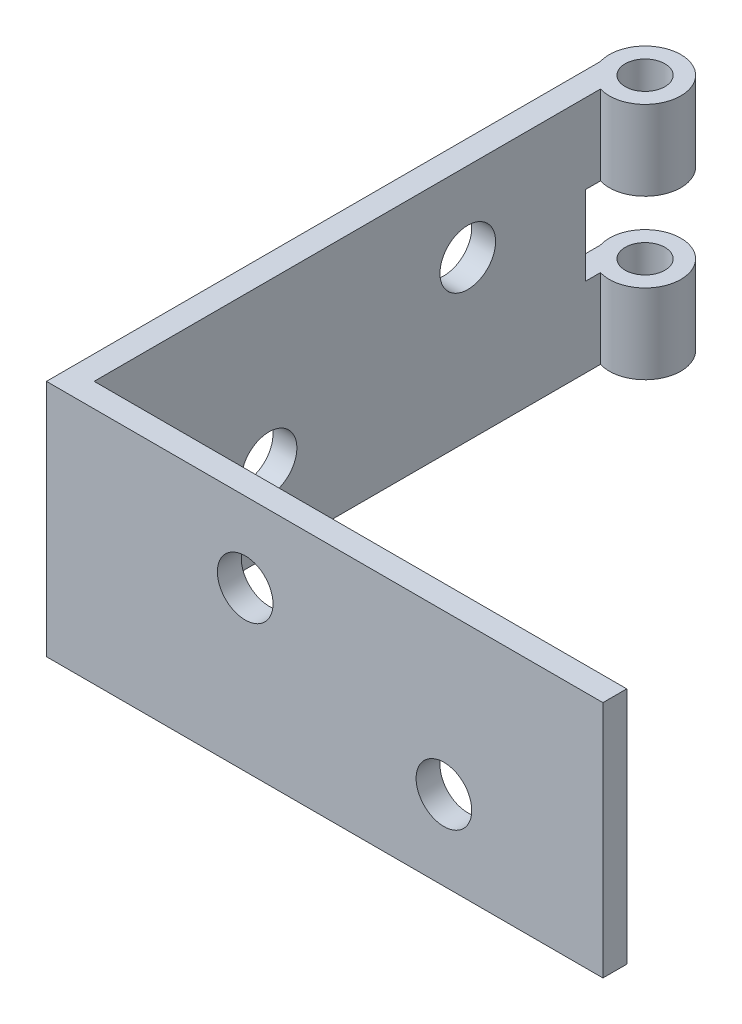
ISO-10303-21;
HEADER;
FILE_DESCRIPTION(('STEP AP214'),'2;1');
FILE_NAME('part.step','',(''),(''),'','','');
FILE_SCHEMA(('AUTOMOTIVE_DESIGN { 1 0 10303 214 1 1 1 1 }'));
ENDSEC;
DATA;
#1=APPLICATION_CONTEXT('core data for automotive mechanical design processes');
#2=APPLICATION_PROTOCOL_DEFINITION('international standard','automotive_design',2000,#1);
#3=PRODUCT_CONTEXT('',#1,'mechanical');
#4=PRODUCT('Part','Part','',(#3));
#5=PRODUCT_RELATED_PRODUCT_CATEGORY('part','',(#4));
#6=PRODUCT_DEFINITION_FORMATION('','',#4);
#7=PRODUCT_DEFINITION_CONTEXT('part definition',#1,'design');
#8=PRODUCT_DEFINITION('design','',#6,#7);
#9=PRODUCT_DEFINITION_SHAPE('','',#8);
#10=(LENGTH_UNIT() NAMED_UNIT(*) SI_UNIT(.MILLI.,.METRE.));
#11=(NAMED_UNIT(*) PLANE_ANGLE_UNIT() SI_UNIT($,.RADIAN.));
#12=(NAMED_UNIT(*) SI_UNIT($,.STERADIAN.) SOLID_ANGLE_UNIT());
#13=UNCERTAINTY_MEASURE_WITH_UNIT(LENGTH_MEASURE(1.E-05),#10,'distance_accuracy_value','');
#14=(GEOMETRIC_REPRESENTATION_CONTEXT(3) GLOBAL_UNCERTAINTY_ASSIGNED_CONTEXT((#13)) GLOBAL_UNIT_ASSIGNED_CONTEXT((#10,
#11,#12)) REPRESENTATION_CONTEXT('',''));
#15=CARTESIAN_POINT('',(0.,0.,0.));
#16=DIRECTION('',(0.,0.,1.));
#17=DIRECTION('',(1.,0.,0.));
#18=AXIS2_PLACEMENT_3D('',#15,#16,#17);
#19=CARTESIAN_POINT('',(4.3,30.,-71.));
#20=DIRECTION('',(0.,-1.,0.));
#21=DIRECTION('',(0.,0.,-1.));
#22=AXIS2_PLACEMENT_3D('',#19,#20,#21);
#23=CYLINDRICAL_SURFACE('',#22,4.5);
#24=DIRECTION('',(0.,-1.,0.));
#25=VECTOR('',#24,1.);
#26=CARTESIAN_POINT('',(0.,30.,-69.6733500838578));
#27=LINE('',#26,#25);
#28=CARTESIAN_POINT('',(0.,10.,-69.6733500838578));
#29=VERTEX_POINT('',#28);
#30=CARTESIAN_POINT('',(0.,0.,-69.6733500838578));
#31=VERTEX_POINT('',#30);
#32=EDGE_CURVE('E57',#29,#31,#27,.T.);
#33=ORIENTED_EDGE('',*,*,#32,.F.);
#34=CARTESIAN_POINT('',(4.3,10.,-71.));
#35=DIRECTION('',(0.,-1.,0.));
#36=DIRECTION('',(0.,0.,-1.));
#37=AXIS2_PLACEMENT_3D('',#34,#35,#36);
#38=CIRCLE('',#37,4.5);
#39=CARTESIAN_POINT('',(3.,10.,-66.6918681542924));
#40=VERTEX_POINT('',#39);
#41=EDGE_CURVE('E133',#29,#40,#38,.T.);
#42=ORIENTED_EDGE('',*,*,#41,.T.);
#43=DIRECTION('',(0.,-1.,0.));
#44=VECTOR('',#43,1.);
#45=CARTESIAN_POINT('',(3.,30.,-66.6918681542924));
#46=LINE('',#45,#44);
#47=CARTESIAN_POINT('',(3.,0.,-66.6918681542924));
#48=VERTEX_POINT('',#47);
#49=EDGE_CURVE('E175',#40,#48,#46,.T.);
#50=ORIENTED_EDGE('',*,*,#49,.T.);
#51=CARTESIAN_POINT('',(4.3,0.,-71.));
#52=DIRECTION('',(0.,1.,0.));
#53=DIRECTION('',(0.,0.,1.));
#54=AXIS2_PLACEMENT_3D('',#51,#52,#53);
#55=CIRCLE('',#54,4.5);
#56=EDGE_CURVE('E167',#48,#31,#55,.T.);
#57=ORIENTED_EDGE('',*,*,#56,.T.);
#58=EDGE_LOOP('',(#33,#42,#50,#57));
#59=FACE_BOUND('',#58,.T.);
#60=ADVANCED_FACE('F42',(#59),#23,.T.);
#61=CARTESIAN_POINT('',(4.3,30.,-71.));
#62=DIRECTION('',(0.,-1.,0.));
#63=DIRECTION('',(0.,0.,-1.));
#64=AXIS2_PLACEMENT_3D('',#61,#62,#63);
#65=CYLINDRICAL_SURFACE('',#64,2.5);
#66=CARTESIAN_POINT('',(4.3,19.9893325701783,-71.));
#67=DIRECTION('',(0.,1.,0.));
#68=DIRECTION('',(0.,0.,1.));
#69=AXIS2_PLACEMENT_3D('',#66,#67,#68);
#70=CIRCLE('',#69,2.5);
#71=CARTESIAN_POINT('',(4.3,19.9893325701783,-68.5));
#72=VERTEX_POINT('',#71);
#73=EDGE_CURVE('E158',#72,#72,#70,.T.);
#74=ORIENTED_EDGE('',*,*,#73,.F.);
#75=EDGE_LOOP('',(#74));
#76=FACE_BOUND('',#75,.T.);
#77=CARTESIAN_POINT('',(4.3,30.,-71.));
#78=DIRECTION('',(0.,1.,0.));
#79=DIRECTION('',(1.,0.,0.));
#80=AXIS2_PLACEMENT_3D('',#77,#78,#79);
#81=CIRCLE('',#80,2.5);
#82=CARTESIAN_POINT('',(6.8,30.,-71.));
#83=VERTEX_POINT('',#82);
#84=EDGE_CURVE('E164',#83,#83,#81,.T.);
#85=ORIENTED_EDGE('',*,*,#84,.T.);
#86=EDGE_LOOP('',(#85));
#87=FACE_BOUND('',#86,.T.);
#88=ADVANCED_FACE('F258',(#76,#87),#65,.F.);
#89=CARTESIAN_POINT('',(0.,30.,0.));
#90=DIRECTION('',(0.,-1.,0.));
#91=DIRECTION('',(-1.,0.,0.));
#92=AXIS2_PLACEMENT_3D('',#89,#90,#91);
#93=PLANE('',#92);
#94=DIRECTION('',(0.,0.,-1.));
#95=VECTOR('',#94,1.);
#96=CARTESIAN_POINT('',(3.,30.,0.));
#97=LINE('',#96,#95);
#98=CARTESIAN_POINT('',(3.,30.,-3.));
#99=VERTEX_POINT('',#98);
#100=CARTESIAN_POINT('',(3.,30.,-66.6918681542924));
#101=VERTEX_POINT('',#100);
#102=EDGE_CURVE('E200',#99,#101,#97,.T.);
#103=ORIENTED_EDGE('',*,*,#102,.T.);
#104=CARTESIAN_POINT('',(4.3,30.,-71.));
#105=DIRECTION('',(0.,1.,0.));
#106=DIRECTION('',(0.,0.,1.));
#107=AXIS2_PLACEMENT_3D('',#104,#105,#106);
#108=CIRCLE('',#107,4.5);
#109=CARTESIAN_POINT('',(0.,30.,-69.6733500838578));
#110=VERTEX_POINT('',#109);
#111=EDGE_CURVE('E170',#101,#110,#108,.T.);
#112=ORIENTED_EDGE('',*,*,#111,.T.);
#113=DIRECTION('',(0.,0.,-1.));
#114=VECTOR('',#113,1.);
#115=CARTESIAN_POINT('',(0.,30.,0.));
#116=LINE('',#115,#114);
#117=CARTESIAN_POINT('',(0.,30.,0.));
#118=VERTEX_POINT('',#117);
#119=EDGE_CURVE('E202',#118,#110,#116,.T.);
#120=ORIENTED_EDGE('',*,*,#119,.F.);
#121=DIRECTION('',(-1.,0.,0.));
#122=VECTOR('',#121,1.);
#123=CARTESIAN_POINT('',(0.,30.,0.));
#124=LINE('',#123,#122);
#125=CARTESIAN_POINT('',(70.,30.,0.));
#126=VERTEX_POINT('',#125);
#127=EDGE_CURVE('E204',#126,#118,#124,.T.);
#128=ORIENTED_EDGE('',*,*,#127,.F.);
#129=DIRECTION('',(0.,0.,1.));
#130=VECTOR('',#129,1.);
#131=CARTESIAN_POINT('',(70.,30.,-3.));
#132=LINE('',#131,#130);
#133=CARTESIAN_POINT('',(70.,30.,-3.));
#134=VERTEX_POINT('',#133);
#135=EDGE_CURVE('E207',#134,#126,#132,.T.);
#136=ORIENTED_EDGE('',*,*,#135,.F.);
#137=DIRECTION('',(1.,0.,0.));
#138=VECTOR('',#137,1.);
#139=CARTESIAN_POINT('',(0.,30.,-3.));
#140=LINE('',#139,#138);
#141=EDGE_CURVE('E66',#134,#99,#140,.F.);
#142=ORIENTED_EDGE('',*,*,#141,.T.);
#143=EDGE_LOOP('',(#103,#112,#120,#128,#136,#142));
#144=FACE_BOUND('',#143,.T.);
#145=ORIENTED_EDGE('',*,*,#84,.F.);
#146=EDGE_LOOP('',(#145));
#147=FACE_BOUND('',#146,.T.);
#148=ADVANCED_FACE('F247',(#144,#147),#93,.F.);
#149=CARTESIAN_POINT('',(0.,0.,0.));
#150=DIRECTION('',(0.,-1.,0.));
#151=DIRECTION('',(-1.,0.,0.));
#152=AXIS2_PLACEMENT_3D('',#149,#150,#151);
#153=PLANE('',#152);
#154=ORIENTED_EDGE('',*,*,#56,.F.);
#155=DIRECTION('',(0.,0.,-1.));
#156=VECTOR('',#155,1.);
#157=CARTESIAN_POINT('',(3.,0.,0.));
#158=LINE('',#157,#156);
#159=CARTESIAN_POINT('',(3.,0.,-3.));
#160=VERTEX_POINT('',#159);
#161=EDGE_CURVE('E199',#160,#48,#158,.T.);
#162=ORIENTED_EDGE('',*,*,#161,.F.);
#163=DIRECTION('',(1.,0.,0.));
#164=VECTOR('',#163,1.);
#165=CARTESIAN_POINT('',(0.,0.,-3.));
#166=LINE('',#165,#164);
#167=CARTESIAN_POINT('',(70.,0.,-3.));
#168=VERTEX_POINT('',#167);
#169=EDGE_CURVE('E87',#168,#160,#166,.F.);
#170=ORIENTED_EDGE('',*,*,#169,.F.);
#171=DIRECTION('',(0.,0.,1.));
#172=VECTOR('',#171,1.);
#173=CARTESIAN_POINT('',(70.,0.,-3.));
#174=LINE('',#173,#172);
#175=CARTESIAN_POINT('',(70.,0.,0.));
#176=VERTEX_POINT('',#175);
#177=EDGE_CURVE('E220',#168,#176,#174,.T.);
#178=ORIENTED_EDGE('',*,*,#177,.T.);
#179=DIRECTION('',(-1.,0.,0.));
#180=VECTOR('',#179,1.);
#181=CARTESIAN_POINT('',(0.,0.,0.));
#182=LINE('',#181,#180);
#183=CARTESIAN_POINT('',(0.,0.,0.));
#184=VERTEX_POINT('',#183);
#185=EDGE_CURVE('E217',#176,#184,#182,.T.);
#186=ORIENTED_EDGE('',*,*,#185,.T.);
#187=DIRECTION('',(0.,0.,-1.));
#188=VECTOR('',#187,1.);
#189=CARTESIAN_POINT('',(0.,0.,0.));
#190=LINE('',#189,#188);
#191=EDGE_CURVE('E214',#184,#31,#190,.T.);
#192=ORIENTED_EDGE('',*,*,#191,.T.);
#193=EDGE_LOOP('',(#154,#162,#170,#178,#186,#192));
#194=FACE_BOUND('',#193,.T.);
#195=CARTESIAN_POINT('',(4.3,0.,-71.));
#196=DIRECTION('',(0.,1.,0.));
#197=DIRECTION('',(1.,0.,0.));
#198=AXIS2_PLACEMENT_3D('',#195,#196,#197);
#199=CIRCLE('',#198,2.5);
#200=CARTESIAN_POINT('',(6.8,0.,-71.));
#201=VERTEX_POINT('',#200);
#202=EDGE_CURVE('E163',#201,#201,#199,.T.);
#203=ORIENTED_EDGE('',*,*,#202,.T.);
#204=EDGE_LOOP('',(#203));
#205=FACE_BOUND('',#204,.T.);
#206=ADVANCED_FACE('F253',(#194,#205),#153,.T.);
#207=CARTESIAN_POINT('',(3.,30.,0.));
#208=DIRECTION('',(-1.,0.,0.));
#209=DIRECTION('',(0.,0.,1.));
#210=AXIS2_PLACEMENT_3D('',#207,#208,#209);
#211=PLANE('',#210);
#212=CARTESIAN_POINT('',(3.,10.,-25.));
#213=DIRECTION('',(-1.,0.,0.));
#214=DIRECTION('',(0.,0.,1.));
#215=AXIS2_PLACEMENT_3D('',#212,#213,#214);
#216=CIRCLE('',#215,3.50000000000002);
#217=CARTESIAN_POINT('',(3.,10.,-21.5));
#218=VERTEX_POINT('',#217);
#219=EDGE_CURVE('E190',#218,#218,#216,.T.);
#220=ORIENTED_EDGE('',*,*,#219,.T.);
#221=EDGE_LOOP('',(#220));
#222=FACE_BOUND('',#221,.T.);
#223=CARTESIAN_POINT('',(3.,20.,-50.));
#224=DIRECTION('',(-1.,0.,0.));
#225=DIRECTION('',(0.,0.,1.));
#226=AXIS2_PLACEMENT_3D('',#223,#224,#225);
#227=CIRCLE('',#226,3.5);
#228=CARTESIAN_POINT('',(3.,20.,-46.5));
#229=VERTEX_POINT('',#228);
#230=EDGE_CURVE('E196',#229,#229,#227,.T.);
#231=ORIENTED_EDGE('',*,*,#230,.T.);
#232=EDGE_LOOP('',(#231));
#233=FACE_BOUND('',#232,.T.);
#234=DIRECTION('',(0.,1.,0.));
#235=VECTOR('',#234,1.);
#236=CARTESIAN_POINT('',(3.,30.,-64.8246430132262));
#237=LINE('',#236,#235);
#238=CARTESIAN_POINT('',(3.,10.,-64.8246430132262));
#239=VERTEX_POINT('',#238);
#240=CARTESIAN_POINT('',(3.,19.9893325701783,-64.8246430132262));
#241=VERTEX_POINT('',#240);
#242=EDGE_CURVE('E142',#239,#241,#237,.T.);
#243=ORIENTED_EDGE('',*,*,#242,.T.);
#244=DIRECTION('',(0.,0.,-1.));
#245=VECTOR('',#244,1.);
#246=CARTESIAN_POINT('',(3.,19.9893325701783,0.));
#247=LINE('',#246,#245);
#248=CARTESIAN_POINT('',(3.,19.9893325701783,-66.6918681542924));
#249=VERTEX_POINT('',#248);
#250=EDGE_CURVE('E153',#241,#249,#247,.T.);
#251=ORIENTED_EDGE('',*,*,#250,.T.);
#252=EDGE_CURVE('E176',#101,#249,#46,.T.);
#253=ORIENTED_EDGE('',*,*,#252,.F.);
#254=ORIENTED_EDGE('',*,*,#102,.F.);
#255=DIRECTION('',(0.,-1.,0.));
#256=VECTOR('',#255,1.);
#257=CARTESIAN_POINT('',(3.,30.,-3.));
#258=LINE('',#257,#256);
#259=EDGE_CURVE('E211',#99,#160,#258,.T.);
#260=ORIENTED_EDGE('',*,*,#259,.T.);
#261=ORIENTED_EDGE('',*,*,#161,.T.);
#262=ORIENTED_EDGE('',*,*,#49,.F.);
#263=DIRECTION('',(0.,0.,1.));
#264=VECTOR('',#263,1.);
#265=CARTESIAN_POINT('',(3.,10.,0.));
#266=LINE('',#265,#264);
#267=EDGE_CURVE('E135',#40,#239,#266,.T.);
#268=ORIENTED_EDGE('',*,*,#267,.T.);
#269=EDGE_LOOP('',(#243,#251,#253,#254,#260,#261,#262,#268));
#270=FACE_BOUND('',#269,.T.);
#271=ADVANCED_FACE('F44',(#222,#233,#270),#211,.F.);
#272=CARTESIAN_POINT('',(0.,30.,0.));
#273=DIRECTION('',(-1.,0.,0.));
#274=DIRECTION('',(0.,0.,1.));
#275=AXIS2_PLACEMENT_3D('',#272,#273,#274);
#276=PLANE('',#275);
#277=DIRECTION('',(0.,0.,-1.));
#278=VECTOR('',#277,1.);
#279=CARTESIAN_POINT('',(0.,19.9893325701783,0.));
#280=LINE('',#279,#278);
#281=CARTESIAN_POINT('',(0.,19.9893325701783,-64.8246430132262));
#282=VERTEX_POINT('',#281);
#283=CARTESIAN_POINT('',(0.,19.9893325701783,-69.6733500838578));
#284=VERTEX_POINT('',#283);
#285=EDGE_CURVE('E150',#282,#284,#280,.T.);
#286=ORIENTED_EDGE('',*,*,#285,.F.);
#287=DIRECTION('',(0.,1.,0.));
#288=VECTOR('',#287,1.);
#289=CARTESIAN_POINT('',(0.,30.,-64.8246430132262));
#290=LINE('',#289,#288);
#291=CARTESIAN_POINT('',(0.,10.,-64.8246430132262));
#292=VERTEX_POINT('',#291);
#293=EDGE_CURVE('E12',#292,#282,#290,.T.);
#294=ORIENTED_EDGE('',*,*,#293,.F.);
#295=DIRECTION('',(0.,0.,1.));
#296=VECTOR('',#295,1.);
#297=CARTESIAN_POINT('',(0.,10.,0.));
#298=LINE('',#297,#296);
#299=EDGE_CURVE('E127',#29,#292,#298,.T.);
#300=ORIENTED_EDGE('',*,*,#299,.F.);
#301=ORIENTED_EDGE('',*,*,#32,.T.);
#302=ORIENTED_EDGE('',*,*,#191,.F.);
#303=DIRECTION('',(0.,-1.,0.));
#304=VECTOR('',#303,1.);
#305=CARTESIAN_POINT('',(0.,30.,0.));
#306=LINE('',#305,#304);
#307=EDGE_CURVE('E50',#118,#184,#306,.T.);
#308=ORIENTED_EDGE('',*,*,#307,.F.);
#309=ORIENTED_EDGE('',*,*,#119,.T.);
#310=EDGE_CURVE('E151',#110,#284,#27,.T.);
#311=ORIENTED_EDGE('',*,*,#310,.T.);
#312=EDGE_LOOP('',(#286,#294,#300,#301,#302,#308,#309,#311));
#313=FACE_BOUND('',#312,.T.);
#314=CARTESIAN_POINT('',(0.,10.,-25.));
#315=DIRECTION('',(-1.,0.,0.));
#316=DIRECTION('',(0.,0.,1.));
#317=AXIS2_PLACEMENT_3D('',#314,#315,#316);
#318=CIRCLE('',#317,3.50000000000002);
#319=CARTESIAN_POINT('',(0.,10.,-21.5));
#320=VERTEX_POINT('',#319);
#321=EDGE_CURVE('E187',#320,#320,#318,.T.);
#322=ORIENTED_EDGE('',*,*,#321,.F.);
#323=EDGE_LOOP('',(#322));
#324=FACE_BOUND('',#323,.T.);
#325=CARTESIAN_POINT('',(0.,20.,-50.));
#326=DIRECTION('',(-1.,0.,0.));
#327=DIRECTION('',(0.,0.,1.));
#328=AXIS2_PLACEMENT_3D('',#325,#326,#327);
#329=CIRCLE('',#328,3.5);
#330=CARTESIAN_POINT('',(0.,20.,-46.5));
#331=VERTEX_POINT('',#330);
#332=EDGE_CURVE('E193',#331,#331,#329,.T.);
#333=ORIENTED_EDGE('',*,*,#332,.F.);
#334=EDGE_LOOP('',(#333));
#335=FACE_BOUND('',#334,.T.);
#336=ADVANCED_FACE('F146',(#313,#324,#335),#276,.T.);
#337=CARTESIAN_POINT('',(0.,30.,0.));
#338=DIRECTION('',(0.,0.,1.));
#339=DIRECTION('',(1.,0.,0.));
#340=AXIS2_PLACEMENT_3D('',#337,#338,#339);
#341=PLANE('',#340);
#342=CARTESIAN_POINT('',(50.,10.,0.));
#343=DIRECTION('',(0.,0.,1.));
#344=DIRECTION('',(1.,0.,0.));
#345=AXIS2_PLACEMENT_3D('',#342,#343,#344);
#346=CIRCLE('',#345,3.5);
#347=CARTESIAN_POINT('',(53.5,10.,0.));
#348=VERTEX_POINT('',#347);
#349=EDGE_CURVE('E179',#348,#348,#346,.T.);
#350=ORIENTED_EDGE('',*,*,#349,.F.);
#351=EDGE_LOOP('',(#350));
#352=FACE_BOUND('',#351,.T.);
#353=CARTESIAN_POINT('',(25.,20.,0.));
#354=DIRECTION('',(0.,0.,1.));
#355=DIRECTION('',(1.,0.,0.));
#356=AXIS2_PLACEMENT_3D('',#353,#354,#355);
#357=CIRCLE('',#356,3.5);
#358=CARTESIAN_POINT('',(28.5,20.,0.));
#359=VERTEX_POINT('',#358);
#360=EDGE_CURVE('E183',#359,#359,#357,.T.);
#361=ORIENTED_EDGE('',*,*,#360,.F.);
#362=EDGE_LOOP('',(#361));
#363=FACE_BOUND('',#362,.T.);
#364=ORIENTED_EDGE('',*,*,#185,.F.);
#365=DIRECTION('',(0.,-1.,0.));
#366=VECTOR('',#365,1.);
#367=CARTESIAN_POINT('',(70.,30.,0.));
#368=LINE('',#367,#366);
#369=EDGE_CURVE('E227',#126,#176,#368,.T.);
#370=ORIENTED_EDGE('',*,*,#369,.F.);
#371=ORIENTED_EDGE('',*,*,#127,.T.);
#372=ORIENTED_EDGE('',*,*,#307,.T.);
#373=EDGE_LOOP('',(#364,#370,#371,#372));
#374=FACE_BOUND('',#373,.T.);
#375=ADVANCED_FACE('F302',(#352,#363,#374),#341,.T.);
#376=CARTESIAN_POINT('',(70.,30.,-3.));
#377=DIRECTION('',(1.,0.,0.));
#378=DIRECTION('',(0.,0.,-1.));
#379=AXIS2_PLACEMENT_3D('',#376,#377,#378);
#380=PLANE('',#379);
#381=ORIENTED_EDGE('',*,*,#177,.F.);
#382=DIRECTION('',(0.,-1.,0.));
#383=VECTOR('',#382,1.);
#384=CARTESIAN_POINT('',(70.,30.,-3.));
#385=LINE('',#384,#383);
#386=EDGE_CURVE('E225',#134,#168,#385,.T.);
#387=ORIENTED_EDGE('',*,*,#386,.F.);
#388=ORIENTED_EDGE('',*,*,#135,.T.);
#389=ORIENTED_EDGE('',*,*,#369,.T.);
#390=EDGE_LOOP('',(#381,#387,#388,#389));
#391=FACE_BOUND('',#390,.T.);
#392=ADVANCED_FACE('F298',(#391),#380,.T.);
#393=CARTESIAN_POINT('',(0.,30.,-3.));
#394=DIRECTION('',(0.,0.,1.));
#395=DIRECTION('',(1.,0.,0.));
#396=AXIS2_PLACEMENT_3D('',#393,#394,#395);
#397=PLANE('',#396);
#398=CARTESIAN_POINT('',(50.,10.,-3.));
#399=DIRECTION('',(0.,0.,1.));
#400=DIRECTION('',(1.,0.,0.));
#401=AXIS2_PLACEMENT_3D('',#398,#399,#400);
#402=CIRCLE('',#401,3.5);
#403=CARTESIAN_POINT('',(53.5,10.,-3.));
#404=VERTEX_POINT('',#403);
#405=EDGE_CURVE('E182',#404,#404,#402,.T.);
#406=ORIENTED_EDGE('',*,*,#405,.T.);
#407=EDGE_LOOP('',(#406));
#408=FACE_BOUND('',#407,.T.);
#409=CARTESIAN_POINT('',(25.,20.,-3.));
#410=DIRECTION('',(0.,0.,1.));
#411=DIRECTION('',(1.,0.,0.));
#412=AXIS2_PLACEMENT_3D('',#409,#410,#411);
#413=CIRCLE('',#412,3.5);
#414=CARTESIAN_POINT('',(28.5,20.,-3.));
#415=VERTEX_POINT('',#414);
#416=EDGE_CURVE('E186',#415,#415,#413,.T.);
#417=ORIENTED_EDGE('',*,*,#416,.T.);
#418=EDGE_LOOP('',(#417));
#419=FACE_BOUND('',#418,.T.);
#420=ORIENTED_EDGE('',*,*,#169,.T.);
#421=ORIENTED_EDGE('',*,*,#259,.F.);
#422=ORIENTED_EDGE('',*,*,#141,.F.);
#423=ORIENTED_EDGE('',*,*,#386,.T.);
#424=EDGE_LOOP('',(#420,#421,#422,#423));
#425=FACE_BOUND('',#424,.T.);
#426=ADVANCED_FACE('F290',(#408,#419,#425),#397,.F.);
#427=CARTESIAN_POINT('',(70.,20.,-50.));
#428=DIRECTION('',(-1.,0.,0.));
#429=DIRECTION('',(0.,0.,1.));
#430=AXIS2_PLACEMENT_3D('',#427,#428,#429);
#431=CYLINDRICAL_SURFACE('',#430,3.5);
#432=ORIENTED_EDGE('',*,*,#332,.T.);
#433=EDGE_LOOP('',(#432));
#434=FACE_BOUND('',#433,.T.);
#435=ORIENTED_EDGE('',*,*,#230,.F.);
#436=EDGE_LOOP('',(#435));
#437=FACE_BOUND('',#436,.T.);
#438=ADVANCED_FACE('F286',(#434,#437),#431,.F.);
#439=CARTESIAN_POINT('',(70.,10.,-25.));
#440=DIRECTION('',(-1.,0.,0.));
#441=DIRECTION('',(0.,0.,1.));
#442=AXIS2_PLACEMENT_3D('',#439,#440,#441);
#443=CYLINDRICAL_SURFACE('',#442,3.50000000000002);
#444=ORIENTED_EDGE('',*,*,#321,.T.);
#445=EDGE_LOOP('',(#444));
#446=FACE_BOUND('',#445,.T.);
#447=ORIENTED_EDGE('',*,*,#219,.F.);
#448=EDGE_LOOP('',(#447));
#449=FACE_BOUND('',#448,.T.);
#450=ADVANCED_FACE('F279',(#446,#449),#443,.F.);
#451=CARTESIAN_POINT('',(25.,20.,-70.));
#452=DIRECTION('',(0.,0.,1.));
#453=DIRECTION('',(1.,0.,0.));
#454=AXIS2_PLACEMENT_3D('',#451,#452,#453);
#455=CYLINDRICAL_SURFACE('',#454,3.5);
#456=ORIENTED_EDGE('',*,*,#360,.T.);
#457=EDGE_LOOP('',(#456));
#458=FACE_BOUND('',#457,.T.);
#459=ORIENTED_EDGE('',*,*,#416,.F.);
#460=EDGE_LOOP('',(#459));
#461=FACE_BOUND('',#460,.T.);
#462=ADVANCED_FACE('F274',(#458,#461),#455,.F.);
#463=CARTESIAN_POINT('',(50.,10.,-70.));
#464=DIRECTION('',(0.,0.,1.));
#465=DIRECTION('',(1.,0.,0.));
#466=AXIS2_PLACEMENT_3D('',#463,#464,#465);
#467=CYLINDRICAL_SURFACE('',#466,3.5);
#468=ORIENTED_EDGE('',*,*,#349,.T.);
#469=EDGE_LOOP('',(#468));
#470=FACE_BOUND('',#469,.T.);
#471=ORIENTED_EDGE('',*,*,#405,.F.);
#472=EDGE_LOOP('',(#471));
#473=FACE_BOUND('',#472,.T.);
#474=ADVANCED_FACE('F268',(#470,#473),#467,.F.);
#475=CARTESIAN_POINT('',(4.3,19.9893325701783,-71.));
#476=DIRECTION('',(0.,1.,0.));
#477=DIRECTION('',(0.,0.,1.));
#478=AXIS2_PLACEMENT_3D('',#475,#476,#477);
#479=CIRCLE('',#478,4.5);
#480=EDGE_CURVE('E154',#249,#284,#479,.T.);
#481=ORIENTED_EDGE('',*,*,#480,.T.);
#482=ORIENTED_EDGE('',*,*,#310,.F.);
#483=ORIENTED_EDGE('',*,*,#111,.F.);
#484=ORIENTED_EDGE('',*,*,#252,.T.);
#485=EDGE_LOOP('',(#481,#482,#483,#484));
#486=FACE_BOUND('',#485,.T.);
#487=ADVANCED_FACE('F246',(#486),#23,.T.);
#488=CARTESIAN_POINT('',(4.3,10.,-71.));
#489=DIRECTION('',(0.,-1.,0.));
#490=DIRECTION('',(0.,0.,-1.));
#491=AXIS2_PLACEMENT_3D('',#488,#489,#490);
#492=CIRCLE('',#491,2.5);
#493=CARTESIAN_POINT('',(4.3,10.,-73.5));
#494=VERTEX_POINT('',#493);
#495=EDGE_CURVE('E234',#494,#494,#492,.T.);
#496=ORIENTED_EDGE('',*,*,#495,.F.);
#497=EDGE_LOOP('',(#496));
#498=FACE_BOUND('',#497,.T.);
#499=ORIENTED_EDGE('',*,*,#202,.F.);
#500=EDGE_LOOP('',(#499));
#501=FACE_BOUND('',#500,.T.);
#502=ADVANCED_FACE('F265',(#498,#501),#65,.F.);
#503=CARTESIAN_POINT('',(-0.200000000000004,19.9893325701783,-64.8246430132262));
#504=DIRECTION('',(0.,0.,1.));
#505=DIRECTION('',(1.,0.,0.));
#506=AXIS2_PLACEMENT_3D('',#503,#504,#505);
#507=PLANE('',#506);
#508=DIRECTION('',(1.,0.,0.));
#509=VECTOR('',#508,1.);
#510=CARTESIAN_POINT('',(-0.200000000000004,10.,-64.8246430132262));
#511=LINE('',#510,#509);
#512=EDGE_CURVE('E130',#292,#239,#511,.T.);
#513=ORIENTED_EDGE('',*,*,#512,.F.);
#514=ORIENTED_EDGE('',*,*,#293,.T.);
#515=DIRECTION('',(1.,0.,0.));
#516=VECTOR('',#515,1.);
#517=CARTESIAN_POINT('',(-0.200000000000004,19.9893325701783,-64.8246430132262));
#518=LINE('',#517,#516);
#519=EDGE_CURVE('E143',#282,#241,#518,.T.);
#520=ORIENTED_EDGE('',*,*,#519,.T.);
#521=ORIENTED_EDGE('',*,*,#242,.F.);
#522=EDGE_LOOP('',(#513,#514,#520,#521));
#523=FACE_BOUND('',#522,.T.);
#524=ADVANCED_FACE('F138',(#523),#507,.F.);
#525=CARTESIAN_POINT('',(-0.200000000000004,19.9893325701783,-64.8246430132262));
#526=DIRECTION('',(0.,1.,0.));
#527=DIRECTION('',(0.,0.,1.));
#528=AXIS2_PLACEMENT_3D('',#525,#526,#527);
#529=PLANE('',#528);
#530=ORIENTED_EDGE('',*,*,#73,.T.);
#531=EDGE_LOOP('',(#530));
#532=FACE_BOUND('',#531,.T.);
#533=ORIENTED_EDGE('',*,*,#519,.F.);
#534=ORIENTED_EDGE('',*,*,#285,.T.);
#535=ORIENTED_EDGE('',*,*,#480,.F.);
#536=ORIENTED_EDGE('',*,*,#250,.F.);
#537=EDGE_LOOP('',(#533,#534,#535,#536));
#538=FACE_BOUND('',#537,.T.);
#539=ADVANCED_FACE('F345',(#532,#538),#529,.F.);
#540=CARTESIAN_POINT('',(-0.200000000000004,10.,-64.8246430132262));
#541=DIRECTION('',(0.,-1.,0.));
#542=DIRECTION('',(0.,0.,-1.));
#543=AXIS2_PLACEMENT_3D('',#540,#541,#542);
#544=PLANE('',#543);
#545=ORIENTED_EDGE('',*,*,#495,.T.);
#546=EDGE_LOOP('',(#545));
#547=FACE_BOUND('',#546,.T.);
#548=ORIENTED_EDGE('',*,*,#41,.F.);
#549=ORIENTED_EDGE('',*,*,#299,.T.);
#550=ORIENTED_EDGE('',*,*,#512,.T.);
#551=ORIENTED_EDGE('',*,*,#267,.F.);
#552=EDGE_LOOP('',(#548,#549,#550,#551));
#553=FACE_BOUND('',#552,.T.);
#554=ADVANCED_FACE('F129',(#547,#553),#544,.F.);
#555=CLOSED_SHELL('',(#60,#88,#148,#206,#271,#336,#375,#392,#426,#438,#450,#462,#474,#487,#502,
#524,#539,#554));
#556=MANIFOLD_SOLID_BREP('B2',#555);
#557=ADVANCED_BREP_SHAPE_REPRESENTATION('',(#18,#556),#14);
#558=SHAPE_DEFINITION_REPRESENTATION(#9,#557);
ENDSEC;
END-ISO-10303-21;
